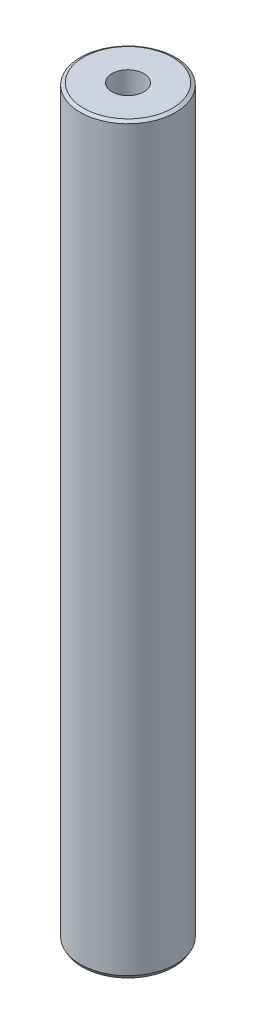
ISO-10303-21;
HEADER;
FILE_DESCRIPTION(('STEP AP214'),'2;1');
FILE_NAME('part.step','',(''),(''),'','','');
FILE_SCHEMA(('AUTOMOTIVE_DESIGN { 1 0 10303 214 1 1 1 1 }'));
ENDSEC;
DATA;
#1=APPLICATION_CONTEXT('core data for automotive mechanical design processes');
#2=APPLICATION_PROTOCOL_DEFINITION('international standard','automotive_design',2000,#1);
#3=PRODUCT_CONTEXT('',#1,'mechanical');
#4=PRODUCT('Part','Part','',(#3));
#5=PRODUCT_RELATED_PRODUCT_CATEGORY('part','',(#4));
#6=PRODUCT_DEFINITION_FORMATION('','',#4);
#7=PRODUCT_DEFINITION_CONTEXT('part definition',#1,'design');
#8=PRODUCT_DEFINITION('design','',#6,#7);
#9=PRODUCT_DEFINITION_SHAPE('','',#8);
#10=(LENGTH_UNIT() NAMED_UNIT(*) SI_UNIT(.MILLI.,.METRE.));
#11=(NAMED_UNIT(*) PLANE_ANGLE_UNIT() SI_UNIT($,.RADIAN.));
#12=(NAMED_UNIT(*) SI_UNIT($,.STERADIAN.) SOLID_ANGLE_UNIT());
#13=UNCERTAINTY_MEASURE_WITH_UNIT(LENGTH_MEASURE(1.E-05),#10,'distance_accuracy_value','');
#14=(GEOMETRIC_REPRESENTATION_CONTEXT(3) GLOBAL_UNCERTAINTY_ASSIGNED_CONTEXT((#13)) GLOBAL_UNIT_ASSIGNED_CONTEXT((#10,
#11,#12)) REPRESENTATION_CONTEXT('',''));
#15=CARTESIAN_POINT('',(0.,0.,0.));
#16=DIRECTION('',(0.,0.,1.));
#17=DIRECTION('',(1.,0.,0.));
#18=AXIS2_PLACEMENT_3D('',#15,#16,#17);
#19=CARTESIAN_POINT('',(0.,506.784050399745,0.));
#20=DIRECTION('',(0.,-1.,0.));
#21=DIRECTION('',(0.,0.,-1.));
#22=AXIS2_PLACEMENT_3D('',#19,#20,#21);
#23=CYLINDRICAL_SURFACE('',#22,32.5);
#24=CARTESIAN_POINT('',(0.,505.479257012847,0.));
#25=DIRECTION('',(0.,1.,0.));
#26=DIRECTION('',(0.,0.,1.));
#27=AXIS2_PLACEMENT_3D('',#24,#25,#26);
#28=CIRCLE('',#27,32.5);
#29=CARTESIAN_POINT('',(0.,505.479257012847,32.5));
#30=VERTEX_POINT('',#29);
#31=EDGE_CURVE('E50',#30,#30,#28,.F.);
#32=ORIENTED_EDGE('',*,*,#31,.T.);
#33=EDGE_LOOP('',(#32));
#34=FACE_BOUND('',#33,.T.);
#35=CARTESIAN_POINT('',(0.,2.25996843948784,0.));
#36=DIRECTION('',(0.,1.,0.));
#37=DIRECTION('',(0.,0.,1.));
#38=AXIS2_PLACEMENT_3D('',#35,#36,#37);
#39=CIRCLE('',#38,32.5);
#40=CARTESIAN_POINT('',(0.,2.25996843948784,32.5));
#41=VERTEX_POINT('',#40);
#42=EDGE_CURVE('E51',#41,#41,#39,.T.);
#43=ORIENTED_EDGE('',*,*,#42,.T.);
#44=EDGE_LOOP('',(#43));
#45=FACE_BOUND('',#44,.T.);
#46=ADVANCED_FACE('F39',(#34,#45),#23,.T.);
#47=CARTESIAN_POINT('',(0.,506.784050399745,0.));
#48=DIRECTION('',(0.,1.,0.));
#49=DIRECTION('',(0.,0.,1.));
#50=AXIS2_PLACEMENT_3D('',#47,#48,#49);
#51=PLANE('',#50);
#52=CARTESIAN_POINT('',(0.,506.784050399745,0.));
#53=DIRECTION('',(0.,1.,0.));
#54=DIRECTION('',(0.,0.,1.));
#55=AXIS2_PLACEMENT_3D('',#52,#53,#54);
#56=CIRCLE('',#55,30.2400315605124);
#57=CARTESIAN_POINT('',(0.,506.784050399745,30.2400315605124));
#58=VERTEX_POINT('',#57);
#59=EDGE_CURVE('E54',#58,#58,#56,.T.);
#60=ORIENTED_EDGE('',*,*,#59,.T.);
#61=EDGE_LOOP('',(#60));
#62=FACE_BOUND('',#61,.T.);
#63=CARTESIAN_POINT('',(0.,506.784050399745,0.));
#64=DIRECTION('',(0.,1.,0.));
#65=DIRECTION('',(0.,0.,1.));
#66=AXIS2_PLACEMENT_3D('',#63,#64,#65);
#67=CIRCLE('',#66,10.8420911364416);
#68=CARTESIAN_POINT('',(0.,506.784050399745,10.8420911364416));
#69=VERTEX_POINT('',#68);
#70=EDGE_CURVE('E58',#69,#69,#67,.T.);
#71=ORIENTED_EDGE('',*,*,#70,.F.);
#72=EDGE_LOOP('',(#71));
#73=FACE_BOUND('',#72,.T.);
#74=ADVANCED_FACE('F69',(#62,#73),#51,.T.);
#75=CARTESIAN_POINT('',(0.,0.,0.));
#76=DIRECTION('',(0.,1.,0.));
#77=DIRECTION('',(0.,0.,1.));
#78=AXIS2_PLACEMENT_3D('',#75,#76,#77);
#79=PLANE('',#78);
#80=CARTESIAN_POINT('',(0.,0.,0.));
#81=DIRECTION('',(0.,1.,0.));
#82=DIRECTION('',(0.,0.,1.));
#83=AXIS2_PLACEMENT_3D('',#80,#81,#82);
#84=CIRCLE('',#83,31.1952066131016);
#85=CARTESIAN_POINT('',(0.,0.,31.1952066131016));
#86=VERTEX_POINT('',#85);
#87=EDGE_CURVE('E10',#86,#86,#84,.F.);
#88=ORIENTED_EDGE('',*,*,#87,.T.);
#89=EDGE_LOOP('',(#88));
#90=FACE_BOUND('',#89,.T.);
#91=CARTESIAN_POINT('',(0.,0.,0.));
#92=DIRECTION('',(0.,1.,0.));
#93=DIRECTION('',(0.,0.,1.));
#94=AXIS2_PLACEMENT_3D('',#91,#92,#93);
#95=CIRCLE('',#94,10.8420911364416);
#96=CARTESIAN_POINT('',(0.,0.,10.8420911364416));
#97=VERTEX_POINT('',#96);
#98=EDGE_CURVE('E63',#97,#97,#95,.T.);
#99=ORIENTED_EDGE('',*,*,#98,.T.);
#100=EDGE_LOOP('',(#99));
#101=FACE_BOUND('',#100,.T.);
#102=ADVANCED_FACE('F75',(#90,#101),#79,.F.);
#103=CARTESIAN_POINT('',(0.,506.784050399745,0.));
#104=DIRECTION('',(0.,-1.,0.));
#105=DIRECTION('',(0.,0.,-1.));
#106=AXIS2_PLACEMENT_3D('',#103,#104,#105);
#107=CYLINDRICAL_SURFACE('',#106,10.8420911364416);
#108=ORIENTED_EDGE('',*,*,#70,.T.);
#109=EDGE_LOOP('',(#108));
#110=FACE_BOUND('',#109,.T.);
#111=ORIENTED_EDGE('',*,*,#98,.F.);
#112=EDGE_LOOP('',(#111));
#113=FACE_BOUND('',#112,.T.);
#114=ADVANCED_FACE('F70',(#110,#113),#107,.F.);
#115=CARTESIAN_POINT('',(0.,506.784050399745,0.));
#116=DIRECTION('',(0.,-1.,0.));
#117=DIRECTION('',(0.,0.,-1.));
#118=AXIS2_PLACEMENT_3D('',#115,#116,#117);
#119=CONICAL_SURFACE('',#118,30.2400315605124,1.04719755119656);
#120=ORIENTED_EDGE('',*,*,#31,.F.);
#121=EDGE_LOOP('',(#120));
#122=FACE_BOUND('',#121,.T.);
#123=ORIENTED_EDGE('',*,*,#59,.F.);
#124=EDGE_LOOP('',(#123));
#125=FACE_BOUND('',#124,.T.);
#126=ADVANCED_FACE('F81',(#122,#125),#119,.T.);
#127=CARTESIAN_POINT('',(0.,2.25996843948784,0.));
#128=DIRECTION('',(0.,1.,0.));
#129=DIRECTION('',(0.,0.,1.));
#130=AXIS2_PLACEMENT_3D('',#127,#128,#129);
#131=CONICAL_SURFACE('',#130,32.5,0.523598775598312);
#132=ORIENTED_EDGE('',*,*,#87,.F.);
#133=EDGE_LOOP('',(#132));
#134=FACE_BOUND('',#133,.T.);
#135=ORIENTED_EDGE('',*,*,#42,.F.);
#136=EDGE_LOOP('',(#135));
#137=FACE_BOUND('',#136,.T.);
#138=ADVANCED_FACE('F45',(#134,#137),#131,.T.);
#139=CLOSED_SHELL('',(#46,#74,#102,#114,#126,#138));
#140=MANIFOLD_SOLID_BREP('B2',#139);
#141=ADVANCED_BREP_SHAPE_REPRESENTATION('',(#18,#140),#14);
#142=SHAPE_DEFINITION_REPRESENTATION(#9,#141);
ENDSEC;
END-ISO-10303-21;
